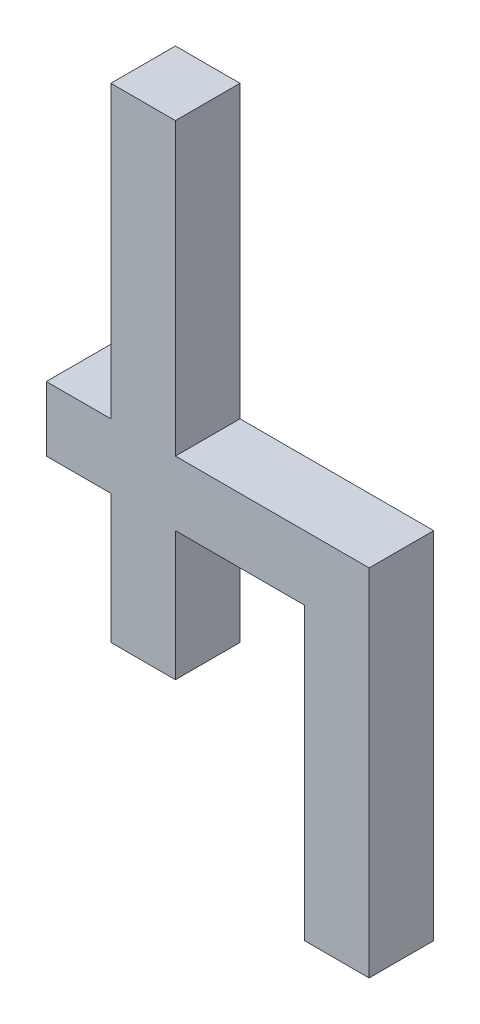
ISO-10303-21;
HEADER;
FILE_DESCRIPTION(('STEP AP214'),'2;1');
FILE_NAME('part.step','',(''),(''),'','','');
FILE_SCHEMA(('AUTOMOTIVE_DESIGN { 1 0 10303 214 1 1 1 1 }'));
ENDSEC;
DATA;
#1=APPLICATION_CONTEXT('core data for automotive mechanical design processes');
#2=APPLICATION_PROTOCOL_DEFINITION('international standard','automotive_design',2000,#1);
#3=PRODUCT_CONTEXT('',#1,'mechanical');
#4=PRODUCT('Part','Part','',(#3));
#5=PRODUCT_RELATED_PRODUCT_CATEGORY('part','',(#4));
#6=PRODUCT_DEFINITION_FORMATION('','',#4);
#7=PRODUCT_DEFINITION_CONTEXT('part definition',#1,'design');
#8=PRODUCT_DEFINITION('design','',#6,#7);
#9=PRODUCT_DEFINITION_SHAPE('','',#8);
#10=(LENGTH_UNIT() NAMED_UNIT(*) SI_UNIT(.MILLI.,.METRE.));
#11=(NAMED_UNIT(*) PLANE_ANGLE_UNIT() SI_UNIT($,.RADIAN.));
#12=(NAMED_UNIT(*) SI_UNIT($,.STERADIAN.) SOLID_ANGLE_UNIT());
#13=UNCERTAINTY_MEASURE_WITH_UNIT(LENGTH_MEASURE(1.E-05),#10,'distance_accuracy_value','');
#14=(GEOMETRIC_REPRESENTATION_CONTEXT(3) GLOBAL_UNCERTAINTY_ASSIGNED_CONTEXT((#13)) GLOBAL_UNIT_ASSIGNED_CONTEXT((#10,
#11,#12)) REPRESENTATION_CONTEXT('',''));
#15=CARTESIAN_POINT('',(0.,0.,0.));
#16=DIRECTION('',(0.,0.,1.));
#17=DIRECTION('',(1.,0.,0.));
#18=AXIS2_PLACEMENT_3D('',#15,#16,#17);
#19=CARTESIAN_POINT('',(0.0635,-0.127,0.0254));
#20=DIRECTION('',(0.,0.,1.));
#21=DIRECTION('',(1.,0.,0.));
#22=AXIS2_PLACEMENT_3D('',#19,#20,#21);
#23=PLANE('',#22);
#24=DIRECTION('',(0.,1.,0.));
#25=VECTOR('',#24,1.);
#26=CARTESIAN_POINT('',(0.0381,-0.127,0.0254));
#27=LINE('',#26,#25);
#28=CARTESIAN_POINT('',(0.0381,-0.127,0.0254));
#29=VERTEX_POINT('',#28);
#30=CARTESIAN_POINT('',(0.0381,-0.01270000000002,0.0254));
#31=VERTEX_POINT('',#30);
#32=EDGE_CURVE('E177',#29,#31,#27,.T.);
#33=ORIENTED_EDGE('',*,*,#32,.F.);
#34=DIRECTION('',(1.,0.,0.));
#35=VECTOR('',#34,1.);
#36=CARTESIAN_POINT('',(0.0635,-0.127,0.0254));
#37=LINE('',#36,#35);
#38=CARTESIAN_POINT('',(0.0635,-0.127,0.0254));
#39=VERTEX_POINT('',#38);
#40=EDGE_CURVE('E130',#39,#29,#37,.F.);
#41=ORIENTED_EDGE('',*,*,#40,.F.);
#42=DIRECTION('',(0.,1.,0.));
#43=VECTOR('',#42,1.);
#44=CARTESIAN_POINT('',(0.0635,0.0127,0.0254));
#45=LINE('',#44,#43);
#46=CARTESIAN_POINT('',(0.0635,0.0127,0.0254));
#47=VERTEX_POINT('',#46);
#48=EDGE_CURVE('E20',#47,#39,#45,.F.);
#49=ORIENTED_EDGE('',*,*,#48,.F.);
#50=DIRECTION('',(1.,0.,0.));
#51=VECTOR('',#50,1.);
#52=CARTESIAN_POINT('',(-0.0127,0.0127,0.0254));
#53=LINE('',#52,#51);
#54=CARTESIAN_POINT('',(-0.0127,0.0127,0.0254));
#55=VERTEX_POINT('',#54);
#56=EDGE_CURVE('E119',#55,#47,#53,.T.);
#57=ORIENTED_EDGE('',*,*,#56,.F.);
#58=DIRECTION('',(0.,1.,0.));
#59=VECTOR('',#58,1.);
#60=CARTESIAN_POINT('',(-0.0127,0.127,0.0254));
#61=LINE('',#60,#59);
#62=CARTESIAN_POINT('',(-0.0127,0.127,0.0254));
#63=VERTEX_POINT('',#62);
#64=EDGE_CURVE('E114',#63,#55,#61,.F.);
#65=ORIENTED_EDGE('',*,*,#64,.F.);
#66=DIRECTION('',(1.,0.,0.));
#67=VECTOR('',#66,1.);
#68=CARTESIAN_POINT('',(-0.0381,0.127,0.0254));
#69=LINE('',#68,#67);
#70=CARTESIAN_POINT('',(-0.0381,0.127,0.0254));
#71=VERTEX_POINT('',#70);
#72=EDGE_CURVE('E141',#71,#63,#69,.T.);
#73=ORIENTED_EDGE('',*,*,#72,.F.);
#74=DIRECTION('',(0.,1.,0.));
#75=VECTOR('',#74,1.);
#76=CARTESIAN_POINT('',(-0.0381,0.0127,0.0254));
#77=LINE('',#76,#75);
#78=CARTESIAN_POINT('',(-0.0381,0.0127,0.0254));
#79=VERTEX_POINT('',#78);
#80=EDGE_CURVE('E145',#79,#71,#77,.T.);
#81=ORIENTED_EDGE('',*,*,#80,.F.);
#82=DIRECTION('',(1.,0.,0.));
#83=VECTOR('',#82,1.);
#84=CARTESIAN_POINT('',(-0.0635,0.0127,0.0254));
#85=LINE('',#84,#83);
#86=CARTESIAN_POINT('',(-0.0635,0.0127,0.0254));
#87=VERTEX_POINT('',#86);
#88=EDGE_CURVE('E149',#87,#79,#85,.T.);
#89=ORIENTED_EDGE('',*,*,#88,.F.);
#90=DIRECTION('',(0.,1.,0.));
#91=VECTOR('',#90,1.);
#92=CARTESIAN_POINT('',(-0.0635,-0.01270000000002,0.0254));
#93=LINE('',#92,#91);
#94=CARTESIAN_POINT('',(-0.0635,-0.01270000000002,0.0254));
#95=VERTEX_POINT('',#94);
#96=EDGE_CURVE('E153',#95,#87,#93,.T.);
#97=ORIENTED_EDGE('',*,*,#96,.F.);
#98=DIRECTION('',(1.,0.,0.));
#99=VECTOR('',#98,1.);
#100=CARTESIAN_POINT('',(-0.0381,-0.01270000000002,0.0254));
#101=LINE('',#100,#99);
#102=CARTESIAN_POINT('',(-0.0381,-0.01270000000002,0.0254));
#103=VERTEX_POINT('',#102);
#104=EDGE_CURVE('E157',#103,#95,#101,.F.);
#105=ORIENTED_EDGE('',*,*,#104,.F.);
#106=DIRECTION('',(0.,1.,0.));
#107=VECTOR('',#106,1.);
#108=CARTESIAN_POINT('',(-0.0381,-0.0635,0.0254));
#109=LINE('',#108,#107);
#110=CARTESIAN_POINT('',(-0.0381,-0.0635,0.0254));
#111=VERTEX_POINT('',#110);
#112=EDGE_CURVE('E161',#111,#103,#109,.T.);
#113=ORIENTED_EDGE('',*,*,#112,.F.);
#114=DIRECTION('',(1.,0.,0.));
#115=VECTOR('',#114,1.);
#116=CARTESIAN_POINT('',(-0.0127,-0.0635,0.0254));
#117=LINE('',#116,#115);
#118=CARTESIAN_POINT('',(-0.0127,-0.0635,0.0254));
#119=VERTEX_POINT('',#118);
#120=EDGE_CURVE('E165',#119,#111,#117,.F.);
#121=ORIENTED_EDGE('',*,*,#120,.F.);
#122=DIRECTION('',(0.,1.,0.));
#123=VECTOR('',#122,1.);
#124=CARTESIAN_POINT('',(-0.0127,-0.01270000000002,0.0254));
#125=LINE('',#124,#123);
#126=CARTESIAN_POINT('',(-0.0127,-0.01270000000002,0.0254));
#127=VERTEX_POINT('',#126);
#128=EDGE_CURVE('E169',#127,#119,#125,.F.);
#129=ORIENTED_EDGE('',*,*,#128,.F.);
#130=DIRECTION('',(1.,0.,0.));
#131=VECTOR('',#130,1.);
#132=CARTESIAN_POINT('',(0.0381,-0.01270000000002,0.0254));
#133=LINE('',#132,#131);
#134=EDGE_CURVE('E173',#31,#127,#133,.F.);
#135=ORIENTED_EDGE('',*,*,#134,.F.);
#136=EDGE_LOOP('',(#33,#41,#49,#57,#65,#73,#81,#89,#97,#105,#113,#121,#129,#135));
#137=FACE_BOUND('',#136,.T.);
#138=ADVANCED_FACE('F17',(#137),#23,.T.);
#139=CARTESIAN_POINT('',(0.0635,0.0127,0.));
#140=DIRECTION('',(1.,0.,0.));
#141=DIRECTION('',(0.,0.,-1.));
#142=AXIS2_PLACEMENT_3D('',#139,#140,#141);
#143=PLANE('',#142);
#144=DIRECTION('',(0.,0.,-1.));
#145=VECTOR('',#144,1.);
#146=CARTESIAN_POINT('',(0.0635,-0.127,0.));
#147=LINE('',#146,#145);
#148=CARTESIAN_POINT('',(0.0635,-0.127,0.));
#149=VERTEX_POINT('',#148);
#150=EDGE_CURVE('E181',#149,#39,#147,.F.);
#151=ORIENTED_EDGE('',*,*,#150,.F.);
#152=DIRECTION('',(0.,1.,0.));
#153=VECTOR('',#152,1.);
#154=CARTESIAN_POINT('',(0.0635,-0.127,0.));
#155=LINE('',#154,#153);
#156=CARTESIAN_POINT('',(0.0635,0.0127,0.));
#157=VERTEX_POINT('',#156);
#158=EDGE_CURVE('E136',#149,#157,#155,.T.);
#159=ORIENTED_EDGE('',*,*,#158,.T.);
#160=DIRECTION('',(0.,0.,1.));
#161=VECTOR('',#160,1.);
#162=CARTESIAN_POINT('',(0.0635,0.0127,0.));
#163=LINE('',#162,#161);
#164=EDGE_CURVE('E124',#47,#157,#163,.F.);
#165=ORIENTED_EDGE('',*,*,#164,.F.);
#166=ORIENTED_EDGE('',*,*,#48,.T.);
#167=EDGE_LOOP('',(#151,#159,#165,#166));
#168=FACE_BOUND('',#167,.T.);
#169=ADVANCED_FACE('F135',(#168),#143,.T.);
#170=CARTESIAN_POINT('',(-0.0127,0.0127,0.));
#171=DIRECTION('',(0.,1.,0.));
#172=DIRECTION('',(0.,0.,1.));
#173=AXIS2_PLACEMENT_3D('',#170,#171,#172);
#174=PLANE('',#173);
#175=ORIENTED_EDGE('',*,*,#164,.T.);
#176=DIRECTION('',(1.,0.,0.));
#177=VECTOR('',#176,1.);
#178=CARTESIAN_POINT('',(0.0635,0.0127,0.));
#179=LINE('',#178,#177);
#180=CARTESIAN_POINT('',(-0.0127,0.0127,0.));
#181=VERTEX_POINT('',#180);
#182=EDGE_CURVE('E186',#157,#181,#179,.F.);
#183=ORIENTED_EDGE('',*,*,#182,.T.);
#184=DIRECTION('',(0.,0.,-1.));
#185=VECTOR('',#184,1.);
#186=CARTESIAN_POINT('',(-0.0127,0.0127,0.));
#187=LINE('',#186,#185);
#188=EDGE_CURVE('E126',#55,#181,#187,.T.);
#189=ORIENTED_EDGE('',*,*,#188,.F.);
#190=ORIENTED_EDGE('',*,*,#56,.T.);
#191=EDGE_LOOP('',(#175,#183,#189,#190));
#192=FACE_BOUND('',#191,.T.);
#193=ADVANCED_FACE('F121',(#192),#174,.T.);
#194=CARTESIAN_POINT('',(-0.0127,0.127,0.));
#195=DIRECTION('',(1.,0.,0.));
#196=DIRECTION('',(0.,0.,-1.));
#197=AXIS2_PLACEMENT_3D('',#194,#195,#196);
#198=PLANE('',#197);
#199=ORIENTED_EDGE('',*,*,#188,.T.);
#200=DIRECTION('',(0.,1.,0.));
#201=VECTOR('',#200,1.);
#202=CARTESIAN_POINT('',(-0.0127,-0.127,0.));
#203=LINE('',#202,#201);
#204=CARTESIAN_POINT('',(-0.0127,0.127,0.));
#205=VERTEX_POINT('',#204);
#206=EDGE_CURVE('E188',#181,#205,#203,.T.);
#207=ORIENTED_EDGE('',*,*,#206,.T.);
#208=DIRECTION('',(0.,0.,1.));
#209=VECTOR('',#208,1.);
#210=CARTESIAN_POINT('',(-0.0127,0.127,0.));
#211=LINE('',#210,#209);
#212=EDGE_CURVE('E143',#63,#205,#211,.F.);
#213=ORIENTED_EDGE('',*,*,#212,.F.);
#214=ORIENTED_EDGE('',*,*,#64,.T.);
#215=EDGE_LOOP('',(#199,#207,#213,#214));
#216=FACE_BOUND('',#215,.T.);
#217=ADVANCED_FACE('F270',(#216),#198,.T.);
#218=CARTESIAN_POINT('',(-0.0381,0.127,0.));
#219=DIRECTION('',(0.,1.,0.));
#220=DIRECTION('',(0.,0.,1.));
#221=AXIS2_PLACEMENT_3D('',#218,#219,#220);
#222=PLANE('',#221);
#223=ORIENTED_EDGE('',*,*,#212,.T.);
#224=DIRECTION('',(1.,0.,0.));
#225=VECTOR('',#224,1.);
#226=CARTESIAN_POINT('',(0.0635,0.127,0.));
#227=LINE('',#226,#225);
#228=CARTESIAN_POINT('',(-0.0381,0.127,0.));
#229=VERTEX_POINT('',#228);
#230=EDGE_CURVE('E191',#205,#229,#227,.F.);
#231=ORIENTED_EDGE('',*,*,#230,.T.);
#232=DIRECTION('',(0.,0.,1.));
#233=VECTOR('',#232,1.);
#234=CARTESIAN_POINT('',(-0.0381,0.127,0.));
#235=LINE('',#234,#233);
#236=EDGE_CURVE('E147',#71,#229,#235,.F.);
#237=ORIENTED_EDGE('',*,*,#236,.F.);
#238=ORIENTED_EDGE('',*,*,#72,.T.);
#239=EDGE_LOOP('',(#223,#231,#237,#238));
#240=FACE_BOUND('',#239,.T.);
#241=ADVANCED_FACE('F269',(#240),#222,.T.);
#242=CARTESIAN_POINT('',(-0.0381,0.0127,0.));
#243=DIRECTION('',(-1.,0.,0.));
#244=DIRECTION('',(0.,0.,1.));
#245=AXIS2_PLACEMENT_3D('',#242,#243,#244);
#246=PLANE('',#245);
#247=ORIENTED_EDGE('',*,*,#236,.T.);
#248=DIRECTION('',(0.,1.,0.));
#249=VECTOR('',#248,1.);
#250=CARTESIAN_POINT('',(-0.0381,-0.127,0.));
#251=LINE('',#250,#249);
#252=CARTESIAN_POINT('',(-0.0381,0.0127,0.));
#253=VERTEX_POINT('',#252);
#254=EDGE_CURVE('E194',#229,#253,#251,.F.);
#255=ORIENTED_EDGE('',*,*,#254,.T.);
#256=DIRECTION('',(0.,0.,1.));
#257=VECTOR('',#256,1.);
#258=CARTESIAN_POINT('',(-0.0381,0.0127,0.));
#259=LINE('',#258,#257);
#260=EDGE_CURVE('E151',#79,#253,#259,.F.);
#261=ORIENTED_EDGE('',*,*,#260,.F.);
#262=ORIENTED_EDGE('',*,*,#80,.T.);
#263=EDGE_LOOP('',(#247,#255,#261,#262));
#264=FACE_BOUND('',#263,.T.);
#265=ADVANCED_FACE('F263',(#264),#246,.T.);
#266=CARTESIAN_POINT('',(-0.0635,0.0127,0.));
#267=DIRECTION('',(0.,1.,0.));
#268=DIRECTION('',(0.,0.,1.));
#269=AXIS2_PLACEMENT_3D('',#266,#267,#268);
#270=PLANE('',#269);
#271=ORIENTED_EDGE('',*,*,#260,.T.);
#272=DIRECTION('',(1.,0.,0.));
#273=VECTOR('',#272,1.);
#274=CARTESIAN_POINT('',(0.0635,0.0127,0.));
#275=LINE('',#274,#273);
#276=CARTESIAN_POINT('',(-0.0635,0.0127,0.));
#277=VERTEX_POINT('',#276);
#278=EDGE_CURVE('E197',#253,#277,#275,.F.);
#279=ORIENTED_EDGE('',*,*,#278,.T.);
#280=DIRECTION('',(0.,0.,1.));
#281=VECTOR('',#280,1.);
#282=CARTESIAN_POINT('',(-0.0635,0.0127,0.));
#283=LINE('',#282,#281);
#284=EDGE_CURVE('E155',#87,#277,#283,.F.);
#285=ORIENTED_EDGE('',*,*,#284,.F.);
#286=ORIENTED_EDGE('',*,*,#88,.T.);
#287=EDGE_LOOP('',(#271,#279,#285,#286));
#288=FACE_BOUND('',#287,.T.);
#289=ADVANCED_FACE('F259',(#288),#270,.T.);
#290=CARTESIAN_POINT('',(-0.0635,-0.01270000000002,0.));
#291=DIRECTION('',(-1.,0.,0.));
#292=DIRECTION('',(0.,0.,1.));
#293=AXIS2_PLACEMENT_3D('',#290,#291,#292);
#294=PLANE('',#293);
#295=ORIENTED_EDGE('',*,*,#284,.T.);
#296=DIRECTION('',(0.,1.,0.));
#297=VECTOR('',#296,1.);
#298=CARTESIAN_POINT('',(-0.0635,-0.127,0.));
#299=LINE('',#298,#297);
#300=CARTESIAN_POINT('',(-0.0635,-0.01270000000002,0.));
#301=VERTEX_POINT('',#300);
#302=EDGE_CURVE('E200',#277,#301,#299,.F.);
#303=ORIENTED_EDGE('',*,*,#302,.T.);
#304=DIRECTION('',(0.,0.,-1.));
#305=VECTOR('',#304,1.);
#306=CARTESIAN_POINT('',(-0.0635,-0.01270000000002,0.));
#307=LINE('',#306,#305);
#308=EDGE_CURVE('E159',#95,#301,#307,.T.);
#309=ORIENTED_EDGE('',*,*,#308,.F.);
#310=ORIENTED_EDGE('',*,*,#96,.T.);
#311=EDGE_LOOP('',(#295,#303,#309,#310));
#312=FACE_BOUND('',#311,.T.);
#313=ADVANCED_FACE('F253',(#312),#294,.T.);
#314=CARTESIAN_POINT('',(-0.0381,-0.01270000000002,0.));
#315=DIRECTION('',(0.,-1.,0.));
#316=DIRECTION('',(0.,0.,-1.));
#317=AXIS2_PLACEMENT_3D('',#314,#315,#316);
#318=PLANE('',#317);
#319=ORIENTED_EDGE('',*,*,#308,.T.);
#320=DIRECTION('',(1.,0.,0.));
#321=VECTOR('',#320,1.);
#322=CARTESIAN_POINT('',(0.0635,-0.01270000000002,0.));
#323=LINE('',#322,#321);
#324=CARTESIAN_POINT('',(-0.0381,-0.01270000000002,0.));
#325=VERTEX_POINT('',#324);
#326=EDGE_CURVE('E203',#301,#325,#323,.T.);
#327=ORIENTED_EDGE('',*,*,#326,.T.);
#328=DIRECTION('',(0.,0.,1.));
#329=VECTOR('',#328,1.);
#330=CARTESIAN_POINT('',(-0.0381,-0.01270000000002,0.));
#331=LINE('',#330,#329);
#332=EDGE_CURVE('E163',#103,#325,#331,.F.);
#333=ORIENTED_EDGE('',*,*,#332,.F.);
#334=ORIENTED_EDGE('',*,*,#104,.T.);
#335=EDGE_LOOP('',(#319,#327,#333,#334));
#336=FACE_BOUND('',#335,.T.);
#337=ADVANCED_FACE('F249',(#336),#318,.T.);
#338=CARTESIAN_POINT('',(-0.0381,-0.0635,0.));
#339=DIRECTION('',(-1.,0.,0.));
#340=DIRECTION('',(0.,0.,1.));
#341=AXIS2_PLACEMENT_3D('',#338,#339,#340);
#342=PLANE('',#341);
#343=ORIENTED_EDGE('',*,*,#332,.T.);
#344=DIRECTION('',(0.,1.,0.));
#345=VECTOR('',#344,1.);
#346=CARTESIAN_POINT('',(-0.0381,-0.127,0.));
#347=LINE('',#346,#345);
#348=CARTESIAN_POINT('',(-0.0381,-0.0635,0.));
#349=VERTEX_POINT('',#348);
#350=EDGE_CURVE('E206',#325,#349,#347,.F.);
#351=ORIENTED_EDGE('',*,*,#350,.T.);
#352=DIRECTION('',(0.,0.,-1.));
#353=VECTOR('',#352,1.);
#354=CARTESIAN_POINT('',(-0.0381,-0.0635,0.));
#355=LINE('',#354,#353);
#356=EDGE_CURVE('E167',#111,#349,#355,.T.);
#357=ORIENTED_EDGE('',*,*,#356,.F.);
#358=ORIENTED_EDGE('',*,*,#112,.T.);
#359=EDGE_LOOP('',(#343,#351,#357,#358));
#360=FACE_BOUND('',#359,.T.);
#361=ADVANCED_FACE('F243',(#360),#342,.T.);
#362=CARTESIAN_POINT('',(-0.0127,-0.0635,0.));
#363=DIRECTION('',(0.,-1.,0.));
#364=DIRECTION('',(0.,0.,-1.));
#365=AXIS2_PLACEMENT_3D('',#362,#363,#364);
#366=PLANE('',#365);
#367=ORIENTED_EDGE('',*,*,#356,.T.);
#368=DIRECTION('',(1.,0.,0.));
#369=VECTOR('',#368,1.);
#370=CARTESIAN_POINT('',(0.0635,-0.0635,0.));
#371=LINE('',#370,#369);
#372=CARTESIAN_POINT('',(-0.0127,-0.0635,0.));
#373=VERTEX_POINT('',#372);
#374=EDGE_CURVE('E209',#349,#373,#371,.T.);
#375=ORIENTED_EDGE('',*,*,#374,.T.);
#376=DIRECTION('',(0.,0.,-1.));
#377=VECTOR('',#376,1.);
#378=CARTESIAN_POINT('',(-0.0127,-0.0635,0.));
#379=LINE('',#378,#377);
#380=EDGE_CURVE('E171',#119,#373,#379,.T.);
#381=ORIENTED_EDGE('',*,*,#380,.F.);
#382=ORIENTED_EDGE('',*,*,#120,.T.);
#383=EDGE_LOOP('',(#367,#375,#381,#382));
#384=FACE_BOUND('',#383,.T.);
#385=ADVANCED_FACE('F239',(#384),#366,.T.);
#386=CARTESIAN_POINT('',(-0.0127,-0.01270000000002,0.));
#387=DIRECTION('',(1.,0.,0.));
#388=DIRECTION('',(0.,0.,-1.));
#389=AXIS2_PLACEMENT_3D('',#386,#387,#388);
#390=PLANE('',#389);
#391=ORIENTED_EDGE('',*,*,#380,.T.);
#392=DIRECTION('',(0.,1.,0.));
#393=VECTOR('',#392,1.);
#394=CARTESIAN_POINT('',(-0.0127,-0.127,0.));
#395=LINE('',#394,#393);
#396=CARTESIAN_POINT('',(-0.0127,-0.01270000000002,0.));
#397=VERTEX_POINT('',#396);
#398=EDGE_CURVE('E212',#373,#397,#395,.T.);
#399=ORIENTED_EDGE('',*,*,#398,.T.);
#400=DIRECTION('',(0.,0.,-1.));
#401=VECTOR('',#400,1.);
#402=CARTESIAN_POINT('',(-0.0127,-0.01270000000002,0.));
#403=LINE('',#402,#401);
#404=EDGE_CURVE('E175',#127,#397,#403,.T.);
#405=ORIENTED_EDGE('',*,*,#404,.F.);
#406=ORIENTED_EDGE('',*,*,#128,.T.);
#407=EDGE_LOOP('',(#391,#399,#405,#406));
#408=FACE_BOUND('',#407,.T.);
#409=ADVANCED_FACE('F233',(#408),#390,.T.);
#410=CARTESIAN_POINT('',(0.0381,-0.01270000000002,0.));
#411=DIRECTION('',(0.,-1.,0.));
#412=DIRECTION('',(0.,0.,-1.));
#413=AXIS2_PLACEMENT_3D('',#410,#411,#412);
#414=PLANE('',#413);
#415=ORIENTED_EDGE('',*,*,#404,.T.);
#416=DIRECTION('',(1.,0.,0.));
#417=VECTOR('',#416,1.);
#418=CARTESIAN_POINT('',(0.0635,-0.01270000000002,0.));
#419=LINE('',#418,#417);
#420=CARTESIAN_POINT('',(0.0381,-0.01270000000002,0.));
#421=VERTEX_POINT('',#420);
#422=EDGE_CURVE('E215',#397,#421,#419,.T.);
#423=ORIENTED_EDGE('',*,*,#422,.T.);
#424=DIRECTION('',(0.,0.,1.));
#425=VECTOR('',#424,1.);
#426=CARTESIAN_POINT('',(0.0381,-0.01270000000002,0.));
#427=LINE('',#426,#425);
#428=EDGE_CURVE('E179',#31,#421,#427,.F.);
#429=ORIENTED_EDGE('',*,*,#428,.F.);
#430=ORIENTED_EDGE('',*,*,#134,.T.);
#431=EDGE_LOOP('',(#415,#423,#429,#430));
#432=FACE_BOUND('',#431,.T.);
#433=ADVANCED_FACE('F228',(#432),#414,.T.);
#434=CARTESIAN_POINT('',(0.0381,-0.127,0.));
#435=DIRECTION('',(-1.,0.,0.));
#436=DIRECTION('',(0.,0.,1.));
#437=AXIS2_PLACEMENT_3D('',#434,#435,#436);
#438=PLANE('',#437);
#439=ORIENTED_EDGE('',*,*,#428,.T.);
#440=DIRECTION('',(0.,1.,0.));
#441=VECTOR('',#440,1.);
#442=CARTESIAN_POINT('',(0.0381,-0.127,0.));
#443=LINE('',#442,#441);
#444=CARTESIAN_POINT('',(0.0381,-0.127,0.));
#445=VERTEX_POINT('',#444);
#446=EDGE_CURVE('E26',#421,#445,#443,.F.);
#447=ORIENTED_EDGE('',*,*,#446,.T.);
#448=DIRECTION('',(0.,0.,-1.));
#449=VECTOR('',#448,1.);
#450=CARTESIAN_POINT('',(0.0381,-0.127,0.));
#451=LINE('',#450,#449);
#452=EDGE_CURVE('E34',#29,#445,#451,.T.);
#453=ORIENTED_EDGE('',*,*,#452,.F.);
#454=ORIENTED_EDGE('',*,*,#32,.T.);
#455=EDGE_LOOP('',(#439,#447,#453,#454));
#456=FACE_BOUND('',#455,.T.);
#457=ADVANCED_FACE('F221',(#456),#438,.T.);
#458=CARTESIAN_POINT('',(0.0635,-0.127,0.));
#459=DIRECTION('',(0.,-1.,0.));
#460=DIRECTION('',(0.,0.,-1.));
#461=AXIS2_PLACEMENT_3D('',#458,#459,#460);
#462=PLANE('',#461);
#463=ORIENTED_EDGE('',*,*,#452,.T.);
#464=DIRECTION('',(1.,0.,0.));
#465=VECTOR('',#464,1.);
#466=CARTESIAN_POINT('',(0.0635,-0.127,0.));
#467=LINE('',#466,#465);
#468=EDGE_CURVE('E11',#445,#149,#467,.T.);
#469=ORIENTED_EDGE('',*,*,#468,.T.);
#470=ORIENTED_EDGE('',*,*,#150,.T.);
#471=ORIENTED_EDGE('',*,*,#40,.T.);
#472=EDGE_LOOP('',(#463,#469,#470,#471));
#473=FACE_BOUND('',#472,.T.);
#474=ADVANCED_FACE('F271',(#473),#462,.T.);
#475=CARTESIAN_POINT('',(0.0635,-0.127,0.));
#476=DIRECTION('',(0.,0.,1.));
#477=DIRECTION('',(1.,0.,0.));
#478=AXIS2_PLACEMENT_3D('',#475,#476,#477);
#479=PLANE('',#478);
#480=ORIENTED_EDGE('',*,*,#446,.F.);
#481=ORIENTED_EDGE('',*,*,#422,.F.);
#482=ORIENTED_EDGE('',*,*,#398,.F.);
#483=ORIENTED_EDGE('',*,*,#374,.F.);
#484=ORIENTED_EDGE('',*,*,#350,.F.);
#485=ORIENTED_EDGE('',*,*,#326,.F.);
#486=ORIENTED_EDGE('',*,*,#302,.F.);
#487=ORIENTED_EDGE('',*,*,#278,.F.);
#488=ORIENTED_EDGE('',*,*,#254,.F.);
#489=ORIENTED_EDGE('',*,*,#230,.F.);
#490=ORIENTED_EDGE('',*,*,#206,.F.);
#491=ORIENTED_EDGE('',*,*,#182,.F.);
#492=ORIENTED_EDGE('',*,*,#158,.F.);
#493=ORIENTED_EDGE('',*,*,#468,.F.);
#494=EDGE_LOOP('',(#480,#481,#482,#483,#484,#485,#486,#487,#488,#489,#490,#491,#492,#493));
#495=FACE_BOUND('',#494,.T.);
#496=ADVANCED_FACE('F225',(#495),#479,.F.);
#497=CLOSED_SHELL('',(#138,#169,#193,#217,#241,#265,#289,#313,#337,#361,#385,#409,#433,#457,
#474,#496));
#498=MANIFOLD_SOLID_BREP('B1',#497);
#499=ADVANCED_BREP_SHAPE_REPRESENTATION('',(#18,#498),#14);
#500=SHAPE_DEFINITION_REPRESENTATION(#9,#499);
ENDSEC;
END-ISO-10303-21;
